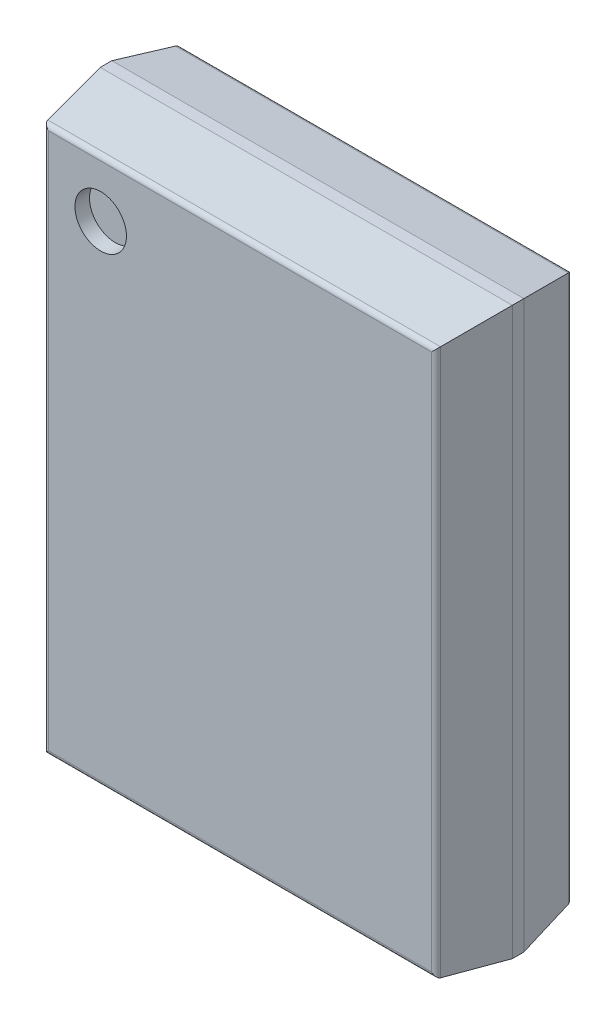
ISO-10303-21;
HEADER;
FILE_DESCRIPTION(('STEP AP214'),'2;1');
FILE_NAME('part.step','',(''),(''),'','','');
FILE_SCHEMA(('AUTOMOTIVE_DESIGN { 1 0 10303 214 1 1 1 1 }'));
ENDSEC;
DATA;
#1=APPLICATION_CONTEXT('core data for automotive mechanical design processes');
#2=APPLICATION_PROTOCOL_DEFINITION('international standard','automotive_design',2000,#1);
#3=PRODUCT_CONTEXT('',#1,'mechanical');
#4=PRODUCT('Part','Part','',(#3));
#5=PRODUCT_RELATED_PRODUCT_CATEGORY('part','',(#4));
#6=PRODUCT_DEFINITION_FORMATION('','',#4);
#7=PRODUCT_DEFINITION_CONTEXT('part definition',#1,'design');
#8=PRODUCT_DEFINITION('design','',#6,#7);
#9=PRODUCT_DEFINITION_SHAPE('','',#8);
#10=(LENGTH_UNIT() NAMED_UNIT(*) SI_UNIT(.MILLI.,.METRE.));
#11=(NAMED_UNIT(*) PLANE_ANGLE_UNIT() SI_UNIT($,.RADIAN.));
#12=(NAMED_UNIT(*) SI_UNIT($,.STERADIAN.) SOLID_ANGLE_UNIT());
#13=UNCERTAINTY_MEASURE_WITH_UNIT(LENGTH_MEASURE(1.E-05),#10,'distance_accuracy_value','');
#14=(GEOMETRIC_REPRESENTATION_CONTEXT(3) GLOBAL_UNCERTAINTY_ASSIGNED_CONTEXT((#13)) GLOBAL_UNIT_ASSIGNED_CONTEXT((#10,
#11,#12)) REPRESENTATION_CONTEXT('',''));
#15=CARTESIAN_POINT('',(0.,0.,0.));
#16=DIRECTION('',(0.,0.,1.));
#17=DIRECTION('',(1.,0.,0.));
#18=AXIS2_PLACEMENT_3D('',#15,#16,#17);
#19=CARTESIAN_POINT('',(-2.535,3.935,2.385));
#20=DIRECTION('',(0.,0.,1.));
#21=DIRECTION('',(1.,0.,0.));
#22=AXIS2_PLACEMENT_3D('',#19,#20,#21);
#23=PLANE('',#22);
#24=CARTESIAN_POINT('',(-2.535,3.935,2.385));
#25=DIRECTION('',(0.,0.,1.));
#26=DIRECTION('',(1.,0.,0.));
#27=AXIS2_PLACEMENT_3D('',#24,#25,#26);
#28=CIRCLE('',#27,0.46875);
#29=CARTESIAN_POINT('',(-2.06625,3.935,2.385));
#30=VERTEX_POINT('',#29);
#31=EDGE_CURVE('E11',#30,#30,#28,.T.);
#32=ORIENTED_EDGE('',*,*,#31,.T.);
#33=EDGE_LOOP('',(#32));
#34=FACE_BOUND('',#33,.T.);
#35=ADVANCED_FACE('F17',(#34),#23,.T.);
#36=CARTESIAN_POINT('',(-2.535,3.935,2.385));
#37=DIRECTION('',(0.,0.,1.));
#38=DIRECTION('',(1.,0.,0.));
#39=AXIS2_PLACEMENT_3D('',#36,#37,#38);
#40=CYLINDRICAL_SURFACE('',#39,0.46875);
#41=DIRECTION('',(0.,0.,1.));
#42=VECTOR('',#41,1.);
#43=CARTESIAN_POINT('',(-2.06625,3.935,2.385));
#44=LINE('',#43,#42);
#45=CARTESIAN_POINT('',(-2.06625,3.935,2.65));
#46=VERTEX_POINT('',#45);
#47=EDGE_CURVE('E25',#30,#46,#44,.T.);
#48=ORIENTED_EDGE('',*,*,#47,.T.);
#49=CARTESIAN_POINT('',(-2.535,3.935,2.65));
#50=DIRECTION('',(0.,0.,1.));
#51=DIRECTION('',(1.,0.,0.));
#52=AXIS2_PLACEMENT_3D('',#49,#50,#51);
#53=CIRCLE('',#52,0.46875);
#54=EDGE_CURVE('E330',#46,#46,#53,.T.);
#55=ORIENTED_EDGE('',*,*,#54,.T.);
#56=ORIENTED_EDGE('',*,*,#47,.F.);
#57=ORIENTED_EDGE('',*,*,#31,.F.);
#58=EDGE_LOOP('',(#48,#55,#56,#57));
#59=FACE_BOUND('',#58,.T.);
#60=ADVANCED_FACE('F339',(#59),#40,.F.);
#61=CARTESIAN_POINT('',(3.485401446479,-4.9625,2.56));
#62=DIRECTION('',(0.,1.,0.));
#63=DIRECTION('',(0.,0.,1.));
#64=AXIS2_PLACEMENT_3D('',#61,#62,#63);
#65=CYLINDRICAL_SURFACE('',#64,0.09);
#66=CARTESIAN_POINT('',(3.485401446479,-4.885401446479,2.56));
#67=DIRECTION('',(-0.707106781186548,-0.707106781186548,0.));
#68=DIRECTION('',(0.707106781186548,-0.707106781186548,0.));
#69=AXIS2_PLACEMENT_3D('',#66,#67,#68);
#70=ELLIPSE('',#69,0.127279220614,0.09);
#71=CARTESIAN_POINT('',(3.574334794564,-4.974334794564,2.573815194477));
#72=VERTEX_POINT('',#71);
#73=CARTESIAN_POINT('',(3.485401446479,-4.885401446479,2.65));
#74=VERTEX_POINT('',#73);
#75=EDGE_CURVE('E242',#72,#74,#70,.T.);
#76=ORIENTED_EDGE('',*,*,#75,.F.);
#77=DIRECTION('',(0.,1.,0.));
#78=VECTOR('',#77,1.);
#79=CARTESIAN_POINT('',(3.574334794564,-4.9625,2.573815194477));
#80=LINE('',#79,#78);
#81=CARTESIAN_POINT('',(3.574334794564,4.974334794564,2.573815194477));
#82=VERTEX_POINT('',#81);
#83=EDGE_CURVE('E238',#72,#82,#80,.T.);
#84=ORIENTED_EDGE('',*,*,#83,.T.);
#85=CARTESIAN_POINT('',(3.485401446479,4.885401446479,2.56));
#86=DIRECTION('',(-0.707106781186548,0.707106781186548,0.));
#87=DIRECTION('',(0.707106781186548,0.707106781186548,0.));
#88=AXIS2_PLACEMENT_3D('',#85,#86,#87);
#89=ELLIPSE('',#88,0.127279220614,0.09);
#90=CARTESIAN_POINT('',(3.485401446479,4.885401446479,2.65));
#91=VERTEX_POINT('',#90);
#92=EDGE_CURVE('E194',#91,#82,#89,.T.);
#93=ORIENTED_EDGE('',*,*,#92,.F.);
#94=DIRECTION('',(0.,1.,0.));
#95=VECTOR('',#94,1.);
#96=CARTESIAN_POINT('',(3.485401446479,-4.9625,2.65));
#97=LINE('',#96,#95);
#98=EDGE_CURVE('E313',#74,#91,#97,.T.);
#99=ORIENTED_EDGE('',*,*,#98,.F.);
#100=EDGE_LOOP('',(#76,#84,#93,#99));
#101=FACE_BOUND('',#100,.T.);
#102=ADVANCED_FACE('F388',(#101),#65,.T.);
#103=CARTESIAN_POINT('',(-3.5625,4.885401446479,2.56));
#104=DIRECTION('',(1.,0.,0.));
#105=DIRECTION('',(0.,0.,1.));
#106=AXIS2_PLACEMENT_3D('',#103,#104,#105);
#107=CYLINDRICAL_SURFACE('',#106,0.09);
#108=DIRECTION('',(1.,0.,0.));
#109=VECTOR('',#108,1.);
#110=CARTESIAN_POINT('',(-3.5625,4.885401446479,2.65));
#111=LINE('',#110,#109);
#112=CARTESIAN_POINT('',(-3.485401446479,4.885401446479,2.65));
#113=VERTEX_POINT('',#112);
#114=EDGE_CURVE('E317',#113,#91,#111,.T.);
#115=ORIENTED_EDGE('',*,*,#114,.T.);
#116=ORIENTED_EDGE('',*,*,#92,.T.);
#117=DIRECTION('',(1.,0.,0.));
#118=VECTOR('',#117,1.);
#119=CARTESIAN_POINT('',(-3.5625,4.974334794564,2.573815194477));
#120=LINE('',#119,#118);
#121=CARTESIAN_POINT('',(-3.574334794564,4.974334794564,2.573815194477));
#122=VERTEX_POINT('',#121);
#123=EDGE_CURVE('E309',#122,#82,#120,.T.);
#124=ORIENTED_EDGE('',*,*,#123,.F.);
#125=CARTESIAN_POINT('',(-3.485401446479,4.885401446479,2.56));
#126=DIRECTION('',(0.707106781186548,0.707106781186548,0.));
#127=DIRECTION('',(-0.707106781186548,0.707106781186548,0.));
#128=AXIS2_PLACEMENT_3D('',#125,#126,#127);
#129=ELLIPSE('',#128,0.127279220614,0.09);
#130=EDGE_CURVE('E305',#122,#113,#129,.T.);
#131=ORIENTED_EDGE('',*,*,#130,.T.);
#132=EDGE_LOOP('',(#115,#116,#124,#131));
#133=FACE_BOUND('',#132,.T.);
#134=ADVANCED_FACE('F345',(#133),#107,.T.);
#135=CARTESIAN_POINT('',(-3.75,-5.15,2.65));
#136=DIRECTION('',(0.,0.,1.));
#137=DIRECTION('',(1.,0.,0.));
#138=AXIS2_PLACEMENT_3D('',#135,#136,#137);
#139=PLANE('',#138);
#140=ORIENTED_EDGE('',*,*,#54,.F.);
#141=EDGE_LOOP('',(#140));
#142=FACE_BOUND('',#141,.T.);
#143=DIRECTION('',(0.,1.,0.));
#144=VECTOR('',#143,1.);
#145=CARTESIAN_POINT('',(-3.485401446479,-4.9625,2.65));
#146=LINE('',#145,#144);
#147=CARTESIAN_POINT('',(-3.485401446479,-4.885401446479,2.65));
#148=VERTEX_POINT('',#147);
#149=EDGE_CURVE('E301',#148,#113,#146,.T.);
#150=ORIENTED_EDGE('',*,*,#149,.F.);
#151=DIRECTION('',(1.,0.,0.));
#152=VECTOR('',#151,1.);
#153=CARTESIAN_POINT('',(-3.5625,-4.885401446479,2.65));
#154=LINE('',#153,#152);
#155=EDGE_CURVE('E318',#148,#74,#154,.T.);
#156=ORIENTED_EDGE('',*,*,#155,.T.);
#157=ORIENTED_EDGE('',*,*,#98,.T.);
#158=ORIENTED_EDGE('',*,*,#114,.F.);
#159=EDGE_LOOP('',(#150,#156,#157,#158));
#160=FACE_BOUND('',#159,.T.);
#161=ADVANCED_FACE('F341',(#142,#160),#139,.T.);
#162=CARTESIAN_POINT('',(-3.5625,-4.885401446479,2.56));
#163=DIRECTION('',(1.,0.,0.));
#164=DIRECTION('',(0.,-0.988148312052828,0.153502160854974));
#165=AXIS2_PLACEMENT_3D('',#162,#163,#164);
#166=CYLINDRICAL_SURFACE('',#165,0.09);
#167=DIRECTION('',(1.,0.,0.));
#168=VECTOR('',#167,1.);
#169=CARTESIAN_POINT('',(-3.5625,-4.974334794564,2.573815194477));
#170=LINE('',#169,#168);
#171=CARTESIAN_POINT('',(-3.574334794564,-4.974334794564,2.573815194477));
#172=VERTEX_POINT('',#171);
#173=EDGE_CURVE('E293',#172,#72,#170,.T.);
#174=ORIENTED_EDGE('',*,*,#173,.T.);
#175=ORIENTED_EDGE('',*,*,#75,.T.);
#176=ORIENTED_EDGE('',*,*,#155,.F.);
#177=CARTESIAN_POINT('',(-3.485401446479,-4.885401446479,2.56));
#178=DIRECTION('',(-0.707106781186548,0.707106781186548,0.));
#179=DIRECTION('',(0.707106781186548,0.707106781186548,0.));
#180=AXIS2_PLACEMENT_3D('',#177,#178,#179);
#181=ELLIPSE('',#180,0.127279220614,0.09);
#182=EDGE_CURVE('E297',#172,#148,#181,.T.);
#183=ORIENTED_EDGE('',*,*,#182,.F.);
#184=EDGE_LOOP('',(#174,#175,#176,#183));
#185=FACE_BOUND('',#184,.T.);
#186=ADVANCED_FACE('F344',(#185),#166,.T.);
#187=CARTESIAN_POINT('',(3.65625,-5.15,2.046497718736));
#188=DIRECTION('',(0.988148312052828,0.,0.153502160854974));
#189=DIRECTION('',(0.,-1.,0.));
#190=AXIS2_PLACEMENT_3D('',#187,#188,#189);
#191=PLANE('',#190);
#192=DIRECTION('',(-0.151725026686995,0.151725026686995,0.976708263788968));
#193=VECTOR('',#192,1.);
#194=CARTESIAN_POINT('',(3.572081356388,-4.972081356388,2.588321382));
#195=LINE('',#194,#193);
#196=CARTESIAN_POINT('',(3.75,-5.15,1.442995437472));
#197=VERTEX_POINT('',#196);
#198=EDGE_CURVE('E289',#197,#72,#195,.T.);
#199=ORIENTED_EDGE('',*,*,#198,.F.);
#200=DIRECTION('',(0.,1.,0.));
#201=VECTOR('',#200,1.);
#202=CARTESIAN_POINT('',(3.75,-5.15,1.442995437472));
#203=LINE('',#202,#201);
#204=CARTESIAN_POINT('',(3.75,5.15,1.442995437472));
#205=VERTEX_POINT('',#204);
#206=EDGE_CURVE('E285',#197,#205,#203,.T.);
#207=ORIENTED_EDGE('',*,*,#206,.T.);
#208=DIRECTION('',(-0.151725026686995,-0.151725026686995,0.976708263788968));
#209=VECTOR('',#208,1.);
#210=CARTESIAN_POINT('',(3.453525865214,4.853525865214,3.351505482051));
#211=LINE('',#210,#209);
#212=EDGE_CURVE('E243',#205,#82,#211,.T.);
#213=ORIENTED_EDGE('',*,*,#212,.T.);
#214=ORIENTED_EDGE('',*,*,#83,.F.);
#215=EDGE_LOOP('',(#199,#207,#213,#214));
#216=FACE_BOUND('',#215,.T.);
#217=ADVANCED_FACE('F385',(#216),#191,.T.);
#218=CARTESIAN_POINT('',(-3.75,5.05625,2.046497718736));
#219=DIRECTION('',(0.,0.988148312052828,0.153502160854974));
#220=DIRECTION('',(1.,0.,0.));
#221=AXIS2_PLACEMENT_3D('',#218,#219,#220);
#222=PLANE('',#221);
#223=ORIENTED_EDGE('',*,*,#123,.T.);
#224=ORIENTED_EDGE('',*,*,#212,.F.);
#225=DIRECTION('',(1.,0.,0.));
#226=VECTOR('',#225,1.);
#227=CARTESIAN_POINT('',(-3.75,5.15,1.442995437472));
#228=LINE('',#227,#226);
#229=CARTESIAN_POINT('',(-3.75,5.15,1.442995437472));
#230=VERTEX_POINT('',#229);
#231=EDGE_CURVE('E281',#230,#205,#228,.T.);
#232=ORIENTED_EDGE('',*,*,#231,.F.);
#233=DIRECTION('',(0.151725026686995,-0.151725026686995,0.976708263788968));
#234=VECTOR('',#233,1.);
#235=CARTESIAN_POINT('',(-3.539852679175,4.939852679175,2.795788904344));
#236=LINE('',#235,#234);
#237=EDGE_CURVE('E255',#230,#122,#236,.T.);
#238=ORIENTED_EDGE('',*,*,#237,.T.);
#239=EDGE_LOOP('',(#223,#224,#232,#238));
#240=FACE_BOUND('',#239,.T.);
#241=ADVANCED_FACE('F389',(#240),#222,.T.);
#242=CARTESIAN_POINT('',(-3.485401446479,-4.9625,2.56));
#243=DIRECTION('',(0.,1.,0.));
#244=DIRECTION('',(-0.988148312052828,0.,0.153502160854974));
#245=AXIS2_PLACEMENT_3D('',#242,#243,#244);
#246=CYLINDRICAL_SURFACE('',#245,0.09);
#247=ORIENTED_EDGE('',*,*,#182,.T.);
#248=ORIENTED_EDGE('',*,*,#149,.T.);
#249=ORIENTED_EDGE('',*,*,#130,.F.);
#250=DIRECTION('',(0.,1.,0.));
#251=VECTOR('',#250,1.);
#252=CARTESIAN_POINT('',(-3.574334794564,-4.9625,2.573815194477));
#253=LINE('',#252,#251);
#254=EDGE_CURVE('E260',#172,#122,#253,.T.);
#255=ORIENTED_EDGE('',*,*,#254,.F.);
#256=EDGE_LOOP('',(#247,#248,#249,#255));
#257=FACE_BOUND('',#256,.T.);
#258=ADVANCED_FACE('F351',(#257),#246,.T.);
#259=CARTESIAN_POINT('',(-3.75,-5.05625,2.046497718736));
#260=DIRECTION('',(0.,0.988148312052828,-0.153502160854974));
#261=DIRECTION('',(-1.,0.,0.));
#262=AXIS2_PLACEMENT_3D('',#259,#260,#261);
#263=PLANE('',#262);
#264=DIRECTION('',(0.151725026686995,0.151725026686995,0.976708263788968));
#265=VECTOR('',#264,1.);
#266=CARTESIAN_POINT('',(-3.658408170349,-5.058408170349,2.032604804294));
#267=LINE('',#266,#265);
#268=CARTESIAN_POINT('',(-3.75,-5.15,1.442995437472));
#269=VERTEX_POINT('',#268);
#270=EDGE_CURVE('E259',#269,#172,#267,.T.);
#271=ORIENTED_EDGE('',*,*,#270,.F.);
#272=DIRECTION('',(1.,0.,0.));
#273=VECTOR('',#272,1.);
#274=CARTESIAN_POINT('',(-3.75,-5.15,1.442995437472));
#275=LINE('',#274,#273);
#276=EDGE_CURVE('E148',#269,#197,#275,.T.);
#277=ORIENTED_EDGE('',*,*,#276,.T.);
#278=ORIENTED_EDGE('',*,*,#198,.T.);
#279=ORIENTED_EDGE('',*,*,#173,.F.);
#280=EDGE_LOOP('',(#271,#277,#278,#279));
#281=FACE_BOUND('',#280,.T.);
#282=ADVANCED_FACE('F355',(#281),#263,.F.);
#283=CARTESIAN_POINT('',(3.75,-5.15,0.175));
#284=DIRECTION('',(1.,0.,0.));
#285=DIRECTION('',(0.,1.,0.));
#286=AXIS2_PLACEMENT_3D('',#283,#284,#285);
#287=PLANE('',#286);
#288=DIRECTION('',(0.,0.,1.));
#289=VECTOR('',#288,1.);
#290=CARTESIAN_POINT('',(3.75,-5.15,0.175));
#291=LINE('',#290,#289);
#292=CARTESIAN_POINT('',(3.75,-5.15,1.232995437472));
#293=VERTEX_POINT('',#292);
#294=EDGE_CURVE('E214',#293,#197,#291,.T.);
#295=ORIENTED_EDGE('',*,*,#294,.F.);
#296=DIRECTION('',(0.,1.,0.));
#297=VECTOR('',#296,1.);
#298=CARTESIAN_POINT('',(3.75,-5.15,1.232995437472));
#299=LINE('',#298,#297);
#300=CARTESIAN_POINT('',(3.75,5.15,1.232995437472));
#301=VERTEX_POINT('',#300);
#302=EDGE_CURVE('E213',#293,#301,#299,.T.);
#303=ORIENTED_EDGE('',*,*,#302,.T.);
#304=DIRECTION('',(0.,0.,1.));
#305=VECTOR('',#304,1.);
#306=CARTESIAN_POINT('',(3.75,5.15,0.175));
#307=LINE('',#306,#305);
#308=EDGE_CURVE('E277',#301,#205,#307,.T.);
#309=ORIENTED_EDGE('',*,*,#308,.T.);
#310=ORIENTED_EDGE('',*,*,#206,.F.);
#311=EDGE_LOOP('',(#295,#303,#309,#310));
#312=FACE_BOUND('',#311,.T.);
#313=ADVANCED_FACE('F383',(#312),#287,.T.);
#314=CARTESIAN_POINT('',(3.487047558109,-4.9625,0.265));
#315=DIRECTION('',(0.,1.,0.));
#316=DIRECTION('',(0.,0.,-1.));
#317=AXIS2_PLACEMENT_3D('',#314,#315,#316);
#318=CYLINDRICAL_SURFACE('',#317,0.09);
#319=DIRECTION('',(0.,1.,0.));
#320=VECTOR('',#319,1.);
#321=CARTESIAN_POINT('',(3.487047558109,-4.9625,0.175));
#322=LINE('',#321,#320);
#323=CARTESIAN_POINT('',(3.487047558109,-4.887047558109,0.175));
#324=VERTEX_POINT('',#323);
#325=CARTESIAN_POINT('',(3.487047558109,4.887047558109,0.175));
#326=VERTEX_POINT('',#325);
#327=EDGE_CURVE('E264',#324,#326,#322,.T.);
#328=ORIENTED_EDGE('',*,*,#327,.T.);
#329=CARTESIAN_POINT('',(3.487047558109,4.887047558109,0.265));
#330=DIRECTION('',(0.707106781186548,-0.707106781186548,0.));
#331=DIRECTION('',(0.707106781186548,0.707106781186548,0.));
#332=AXIS2_PLACEMENT_3D('',#329,#330,#331);
#333=ELLIPSE('',#332,0.127279220614,0.09);
#334=CARTESIAN_POINT('',(3.575666659668,4.975666659668,0.249294751231));
#335=VERTEX_POINT('',#334);
#336=EDGE_CURVE('E268',#326,#335,#333,.T.);
#337=ORIENTED_EDGE('',*,*,#336,.T.);
#338=DIRECTION('',(0.,1.,0.));
#339=VECTOR('',#338,1.);
#340=CARTESIAN_POINT('',(3.575666659668,-4.9625,0.249294751231));
#341=LINE('',#340,#339);
#342=CARTESIAN_POINT('',(3.575666659668,-4.975666659668,0.249294751231));
#343=VERTEX_POINT('',#342);
#344=EDGE_CURVE('E209',#343,#335,#341,.T.);
#345=ORIENTED_EDGE('',*,*,#344,.F.);
#346=CARTESIAN_POINT('',(3.487047558109,-4.887047558109,0.265));
#347=DIRECTION('',(0.707106781186548,0.707106781186548,0.));
#348=DIRECTION('',(0.707106781186548,-0.707106781186548,0.));
#349=AXIS2_PLACEMENT_3D('',#346,#347,#348);
#350=ELLIPSE('',#349,0.127279220614,0.09);
#351=EDGE_CURVE('E237',#343,#324,#350,.T.);
#352=ORIENTED_EDGE('',*,*,#351,.T.);
#353=EDGE_LOOP('',(#328,#337,#345,#352));
#354=FACE_BOUND('',#353,.T.);
#355=ADVANCED_FACE('F457',(#354),#318,.T.);
#356=CARTESIAN_POINT('',(-3.75,5.15,0.175));
#357=DIRECTION('',(0.,1.,0.));
#358=DIRECTION('',(1.,0.,0.));
#359=AXIS2_PLACEMENT_3D('',#356,#357,#358);
#360=PLANE('',#359);
#361=ORIENTED_EDGE('',*,*,#308,.F.);
#362=DIRECTION('',(1.,0.,0.));
#363=VECTOR('',#362,1.);
#364=CARTESIAN_POINT('',(-3.75,5.15,1.232995437472));
#365=LINE('',#364,#363);
#366=CARTESIAN_POINT('',(-3.75,5.15,1.232995437472));
#367=VERTEX_POINT('',#366);
#368=EDGE_CURVE('E154',#367,#301,#365,.T.);
#369=ORIENTED_EDGE('',*,*,#368,.F.);
#370=DIRECTION('',(0.,0.,1.));
#371=VECTOR('',#370,1.);
#372=CARTESIAN_POINT('',(-3.75,5.15,0.175));
#373=LINE('',#372,#371);
#374=EDGE_CURVE('E155',#367,#230,#373,.T.);
#375=ORIENTED_EDGE('',*,*,#374,.T.);
#376=ORIENTED_EDGE('',*,*,#231,.T.);
#377=EDGE_LOOP('',(#361,#369,#375,#376));
#378=FACE_BOUND('',#377,.T.);
#379=ADVANCED_FACE('F361',(#378),#360,.T.);
#380=CARTESIAN_POINT('',(-3.65625,-5.15,2.046497718736));
#381=DIRECTION('',(0.988148312052828,0.,-0.153502160854974));
#382=DIRECTION('',(0.,-1.,0.));
#383=AXIS2_PLACEMENT_3D('',#380,#381,#382);
#384=PLANE('',#383);
#385=ORIENTED_EDGE('',*,*,#254,.T.);
#386=ORIENTED_EDGE('',*,*,#237,.F.);
#387=DIRECTION('',(0.,1.,0.));
#388=VECTOR('',#387,1.);
#389=CARTESIAN_POINT('',(-3.75,-5.15,1.442995437472));
#390=LINE('',#389,#388);
#391=EDGE_CURVE('E221',#269,#230,#390,.T.);
#392=ORIENTED_EDGE('',*,*,#391,.F.);
#393=ORIENTED_EDGE('',*,*,#270,.T.);
#394=EDGE_LOOP('',(#385,#386,#392,#393));
#395=FACE_BOUND('',#394,.T.);
#396=ADVANCED_FACE('F357',(#395),#384,.F.);
#397=CARTESIAN_POINT('',(-3.5625,4.887047558109,0.265));
#398=DIRECTION('',(1.,0.,0.));
#399=DIRECTION('',(0.,0.,-1.));
#400=AXIS2_PLACEMENT_3D('',#397,#398,#399);
#401=CYLINDRICAL_SURFACE('',#400,0.09);
#402=CARTESIAN_POINT('',(-3.487047558109,4.887047558109,0.265));
#403=DIRECTION('',(-0.707106781186548,-0.707106781186548,0.));
#404=DIRECTION('',(-0.707106781186548,0.707106781186548,0.));
#405=AXIS2_PLACEMENT_3D('',#402,#403,#404);
#406=ELLIPSE('',#405,0.127279220614,0.09);
#407=CARTESIAN_POINT('',(-3.575666659668,4.975666659668,0.249294751231));
#408=VERTEX_POINT('',#407);
#409=CARTESIAN_POINT('',(-3.487047558109,4.887047558109,0.175));
#410=VERTEX_POINT('',#409);
#411=EDGE_CURVE('E166',#408,#410,#406,.T.);
#412=ORIENTED_EDGE('',*,*,#411,.F.);
#413=DIRECTION('',(1.,0.,0.));
#414=VECTOR('',#413,1.);
#415=CARTESIAN_POINT('',(-3.5625,4.975666659668,0.249294751231));
#416=LINE('',#415,#414);
#417=EDGE_CURVE('E189',#408,#335,#416,.T.);
#418=ORIENTED_EDGE('',*,*,#417,.T.);
#419=ORIENTED_EDGE('',*,*,#336,.F.);
#420=DIRECTION('',(1.,0.,0.));
#421=VECTOR('',#420,1.);
#422=CARTESIAN_POINT('',(-3.5625,4.887047558109,0.175));
#423=LINE('',#422,#421);
#424=EDGE_CURVE('E254',#410,#326,#423,.T.);
#425=ORIENTED_EDGE('',*,*,#424,.F.);
#426=EDGE_LOOP('',(#412,#418,#419,#425));
#427=FACE_BOUND('',#426,.T.);
#428=ADVANCED_FACE('F369',(#427),#401,.T.);
#429=CARTESIAN_POINT('',(-3.75,-5.15,0.175));
#430=DIRECTION('',(0.,0.,1.));
#431=DIRECTION('',(1.,0.,0.));
#432=AXIS2_PLACEMENT_3D('',#429,#430,#431);
#433=PLANE('',#432);
#434=ORIENTED_EDGE('',*,*,#424,.T.);
#435=ORIENTED_EDGE('',*,*,#327,.F.);
#436=DIRECTION('',(1.,0.,0.));
#437=VECTOR('',#436,1.);
#438=CARTESIAN_POINT('',(-3.5625,-4.887047558109,0.175));
#439=LINE('',#438,#437);
#440=CARTESIAN_POINT('',(-3.487047558109,-4.887047558109,0.175));
#441=VERTEX_POINT('',#440);
#442=EDGE_CURVE('E233',#441,#324,#439,.T.);
#443=ORIENTED_EDGE('',*,*,#442,.F.);
#444=DIRECTION('',(0.,1.,0.));
#445=VECTOR('',#444,1.);
#446=CARTESIAN_POINT('',(-3.487047558109,-4.9625,0.175));
#447=LINE('',#446,#445);
#448=EDGE_CURVE('E204',#441,#410,#447,.T.);
#449=ORIENTED_EDGE('',*,*,#448,.T.);
#450=EDGE_LOOP('',(#434,#435,#443,#449));
#451=FACE_BOUND('',#450,.T.);
#452=ADVANCED_FACE('F494',(#451),#433,.F.);
#453=CARTESIAN_POINT('',(3.65625,-5.15,0.703997718736));
#454=DIRECTION('',(-0.984656683987068,0.,0.174502764103012));
#455=DIRECTION('',(0.,1.,0.));
#456=AXIS2_PLACEMENT_3D('',#453,#454,#455);
#457=PLANE('',#456);
#458=ORIENTED_EDGE('',*,*,#344,.T.);
#459=DIRECTION('',(-0.171905033280046,-0.171905033280046,-0.969998618074259));
#460=VECTOR('',#459,1.);
#461=CARTESIAN_POINT('',(3.396013508012,4.796013508012,-0.764423727594));
#462=LINE('',#461,#460);
#463=EDGE_CURVE('E229',#301,#335,#462,.T.);
#464=ORIENTED_EDGE('',*,*,#463,.F.);
#465=ORIENTED_EDGE('',*,*,#302,.F.);
#466=DIRECTION('',(-0.171905033280046,0.171905033280046,-0.969998618074259));
#467=VECTOR('',#466,1.);
#468=CARTESIAN_POINT('',(3.548202911417,-4.948202911417,0.09432664272241));
#469=LINE('',#468,#467);
#470=EDGE_CURVE('E164',#293,#343,#469,.T.);
#471=ORIENTED_EDGE('',*,*,#470,.T.);
#472=EDGE_LOOP('',(#458,#464,#465,#471));
#473=FACE_BOUND('',#472,.T.);
#474=ADVANCED_FACE('F379',(#473),#457,.F.);
#475=CARTESIAN_POINT('',(-3.75,-5.15,0.175));
#476=DIRECTION('',(0.,1.,0.));
#477=DIRECTION('',(1.,0.,0.));
#478=AXIS2_PLACEMENT_3D('',#475,#476,#477);
#479=PLANE('',#478);
#480=ORIENTED_EDGE('',*,*,#276,.F.);
#481=DIRECTION('',(0.,0.,1.));
#482=VECTOR('',#481,1.);
#483=CARTESIAN_POINT('',(-3.75,-5.15,0.175));
#484=LINE('',#483,#482);
#485=CARTESIAN_POINT('',(-3.75,-5.15,1.232995437472));
#486=VERTEX_POINT('',#485);
#487=EDGE_CURVE('E141',#486,#269,#484,.T.);
#488=ORIENTED_EDGE('',*,*,#487,.F.);
#489=DIRECTION('',(1.,0.,0.));
#490=VECTOR('',#489,1.);
#491=CARTESIAN_POINT('',(-3.75,-5.15,1.232995437472));
#492=LINE('',#491,#490);
#493=EDGE_CURVE('E145',#486,#293,#492,.T.);
#494=ORIENTED_EDGE('',*,*,#493,.T.);
#495=ORIENTED_EDGE('',*,*,#294,.T.);
#496=EDGE_LOOP('',(#480,#488,#494,#495));
#497=FACE_BOUND('',#496,.T.);
#498=ADVANCED_FACE('F143',(#497),#479,.F.);
#499=CARTESIAN_POINT('',(-3.5625,-4.887047558109,0.265));
#500=DIRECTION('',(1.,0.,0.));
#501=DIRECTION('',(0.,-0.984656683987068,-0.174502764103012));
#502=AXIS2_PLACEMENT_3D('',#499,#500,#501);
#503=CYLINDRICAL_SURFACE('',#502,0.09);
#504=CARTESIAN_POINT('',(-3.487047558109,-4.887047558109,0.265));
#505=DIRECTION('',(0.707106781186548,-0.707106781186548,0.));
#506=DIRECTION('',(0.707106781186548,0.707106781186548,0.));
#507=AXIS2_PLACEMENT_3D('',#504,#505,#506);
#508=ELLIPSE('',#507,0.127279220614,0.09);
#509=CARTESIAN_POINT('',(-3.575666659668,-4.975666659668,0.249294751231));
#510=VERTEX_POINT('',#509);
#511=EDGE_CURVE('E208',#510,#441,#508,.T.);
#512=ORIENTED_EDGE('',*,*,#511,.T.);
#513=ORIENTED_EDGE('',*,*,#442,.T.);
#514=ORIENTED_EDGE('',*,*,#351,.F.);
#515=DIRECTION('',(1.,0.,0.));
#516=VECTOR('',#515,1.);
#517=CARTESIAN_POINT('',(-3.5625,-4.975666659668,0.249294751231));
#518=LINE('',#517,#516);
#519=EDGE_CURVE('E199',#510,#343,#518,.T.);
#520=ORIENTED_EDGE('',*,*,#519,.F.);
#521=EDGE_LOOP('',(#512,#513,#514,#520));
#522=FACE_BOUND('',#521,.T.);
#523=ADVANCED_FACE('F376',(#522),#503,.T.);
#524=CARTESIAN_POINT('',(-3.75,5.05625,0.703997718736));
#525=DIRECTION('',(0.,-0.984656683987068,0.174502764103012));
#526=DIRECTION('',(-1.,0.,0.));
#527=AXIS2_PLACEMENT_3D('',#524,#525,#526);
#528=PLANE('',#527);
#529=DIRECTION('',(0.171905033280046,-0.171905033280046,-0.969998618074259));
#530=VECTOR('',#529,1.);
#531=CARTESIAN_POINT('',(-3.506831034764,4.906831034764,-0.139120059888));
#532=LINE('',#531,#530);
#533=EDGE_CURVE('E177',#367,#408,#532,.T.);
#534=ORIENTED_EDGE('',*,*,#533,.F.);
#535=ORIENTED_EDGE('',*,*,#368,.T.);
#536=ORIENTED_EDGE('',*,*,#463,.T.);
#537=ORIENTED_EDGE('',*,*,#417,.F.);
#538=EDGE_LOOP('',(#534,#535,#536,#537));
#539=FACE_BOUND('',#538,.T.);
#540=ADVANCED_FACE('F363',(#539),#528,.F.);
#541=CARTESIAN_POINT('',(-3.75,-5.15,0.175));
#542=DIRECTION('',(1.,0.,0.));
#543=DIRECTION('',(0.,1.,0.));
#544=AXIS2_PLACEMENT_3D('',#541,#542,#543);
#545=PLANE('',#544);
#546=ORIENTED_EDGE('',*,*,#391,.T.);
#547=ORIENTED_EDGE('',*,*,#374,.F.);
#548=DIRECTION('',(0.,1.,0.));
#549=VECTOR('',#548,1.);
#550=CARTESIAN_POINT('',(-3.75,-5.15,1.232995437472));
#551=LINE('',#550,#549);
#552=EDGE_CURVE('E170',#486,#367,#551,.T.);
#553=ORIENTED_EDGE('',*,*,#552,.F.);
#554=ORIENTED_EDGE('',*,*,#487,.T.);
#555=EDGE_LOOP('',(#546,#547,#553,#554));
#556=FACE_BOUND('',#555,.T.);
#557=ADVANCED_FACE('F171',(#556),#545,.F.);
#558=CARTESIAN_POINT('',(-3.487047558109,-4.9625,0.265));
#559=DIRECTION('',(0.,1.,0.));
#560=DIRECTION('',(-0.984656683987068,0.,-0.174502764103012));
#561=AXIS2_PLACEMENT_3D('',#558,#559,#560);
#562=CYLINDRICAL_SURFACE('',#561,0.09);
#563=DIRECTION('',(0.,1.,0.));
#564=VECTOR('',#563,1.);
#565=CARTESIAN_POINT('',(-3.575666659668,-4.9625,0.249294751231));
#566=LINE('',#565,#564);
#567=EDGE_CURVE('E182',#510,#408,#566,.T.);
#568=ORIENTED_EDGE('',*,*,#567,.T.);
#569=ORIENTED_EDGE('',*,*,#411,.T.);
#570=ORIENTED_EDGE('',*,*,#448,.F.);
#571=ORIENTED_EDGE('',*,*,#511,.F.);
#572=EDGE_LOOP('',(#568,#569,#570,#571));
#573=FACE_BOUND('',#572,.T.);
#574=ADVANCED_FACE('F372',(#573),#562,.T.);
#575=CARTESIAN_POINT('',(-3.75,-5.05625,0.703997718736));
#576=DIRECTION('',(0.,-0.984656683987068,-0.174502764103012));
#577=DIRECTION('',(0.,0.174502764103012,-0.984656683987068));
#578=AXIS2_PLACEMENT_3D('',#575,#576,#577);
#579=PLANE('',#578);
#580=ORIENTED_EDGE('',*,*,#519,.T.);
#581=ORIENTED_EDGE('',*,*,#470,.F.);
#582=ORIENTED_EDGE('',*,*,#493,.F.);
#583=DIRECTION('',(0.171905033280046,0.171905033280046,-0.969998618074259));
#584=VECTOR('',#583,1.);
#585=CARTESIAN_POINT('',(-3.659020438169,-5.059020438169,0.719630310429));
#586=LINE('',#585,#584);
#587=EDGE_CURVE('E162',#486,#510,#586,.T.);
#588=ORIENTED_EDGE('',*,*,#587,.T.);
#589=EDGE_LOOP('',(#580,#581,#582,#588));
#590=FACE_BOUND('',#589,.T.);
#591=ADVANCED_FACE('F160',(#590),#579,.T.);
#592=CARTESIAN_POINT('',(-3.65625,-5.15,0.703997718736));
#593=DIRECTION('',(-0.984656683987068,0.,-0.174502764103012));
#594=DIRECTION('',(-0.174502764103012,0.,0.984656683987068));
#595=AXIS2_PLACEMENT_3D('',#592,#593,#594);
#596=PLANE('',#595);
#597=ORIENTED_EDGE('',*,*,#587,.F.);
#598=ORIENTED_EDGE('',*,*,#552,.T.);
#599=ORIENTED_EDGE('',*,*,#533,.T.);
#600=ORIENTED_EDGE('',*,*,#567,.F.);
#601=EDGE_LOOP('',(#597,#598,#599,#600));
#602=FACE_BOUND('',#601,.T.);
#603=ADVANCED_FACE('F180',(#602),#596,.T.);
#604=CLOSED_SHELL('',(#35,#60,#102,#134,#161,#186,#217,#241,#258,#282,#313,#355,#379,#396,#428,
#452,#474,#498,#523,#540,#557,#574,#591,#603));
#605=MANIFOLD_SOLID_BREP('B1',#604);
#606=ADVANCED_BREP_SHAPE_REPRESENTATION('',(#18,#605),#14);
#607=SHAPE_DEFINITION_REPRESENTATION(#9,#606);
ENDSEC;
END-ISO-10303-21;
